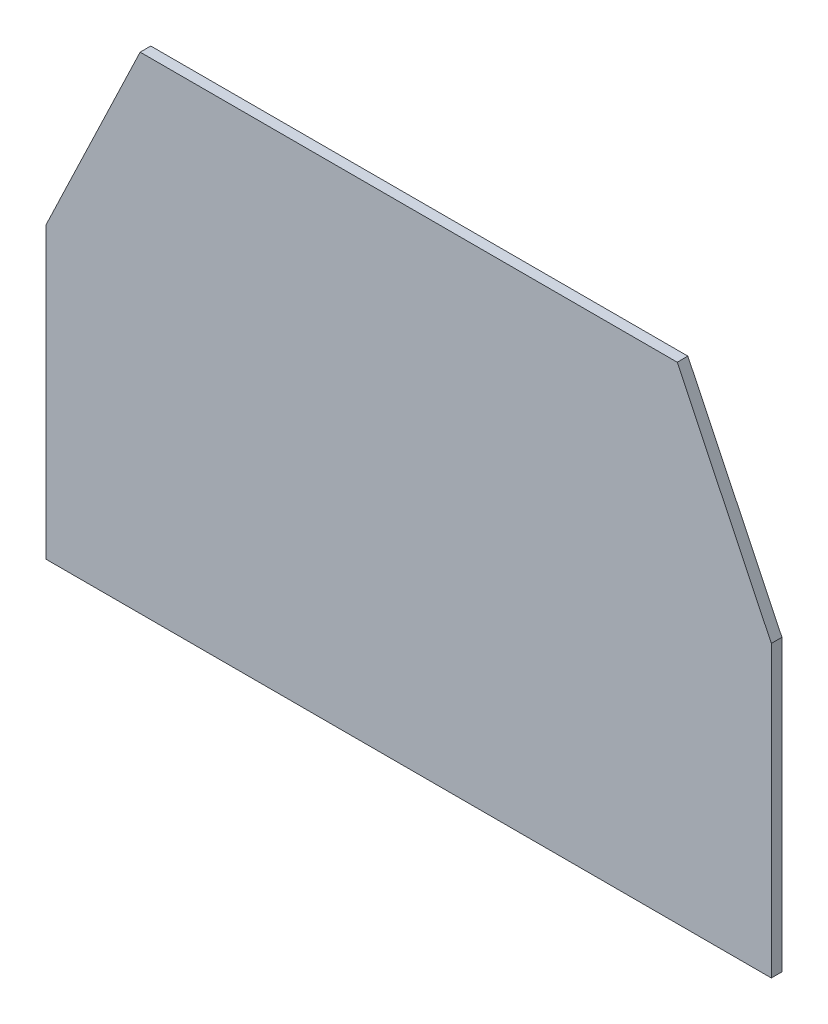
ISO-10303-21;
HEADER;
FILE_DESCRIPTION(('STEP AP214'),'2;1');
FILE_NAME('part.step','',(''),(''),'','','');
FILE_SCHEMA(('AUTOMOTIVE_DESIGN { 1 0 10303 214 1 1 1 1 }'));
ENDSEC;
DATA;
#1=APPLICATION_CONTEXT('core data for automotive mechanical design processes');
#2=APPLICATION_PROTOCOL_DEFINITION('international standard','automotive_design',2000,#1);
#3=PRODUCT_CONTEXT('',#1,'mechanical');
#4=PRODUCT('Part','Part','',(#3));
#5=PRODUCT_RELATED_PRODUCT_CATEGORY('part','',(#4));
#6=PRODUCT_DEFINITION_FORMATION('','',#4);
#7=PRODUCT_DEFINITION_CONTEXT('part definition',#1,'design');
#8=PRODUCT_DEFINITION('design','',#6,#7);
#9=PRODUCT_DEFINITION_SHAPE('','',#8);
#10=(LENGTH_UNIT() NAMED_UNIT(*) SI_UNIT(.MILLI.,.METRE.));
#11=(NAMED_UNIT(*) PLANE_ANGLE_UNIT() SI_UNIT($,.RADIAN.));
#12=(NAMED_UNIT(*) SI_UNIT($,.STERADIAN.) SOLID_ANGLE_UNIT());
#13=UNCERTAINTY_MEASURE_WITH_UNIT(LENGTH_MEASURE(1.E-05),#10,'distance_accuracy_value','');
#14=(GEOMETRIC_REPRESENTATION_CONTEXT(3) GLOBAL_UNCERTAINTY_ASSIGNED_CONTEXT((#13)) GLOBAL_UNIT_ASSIGNED_CONTEXT((#10,
#11,#12)) REPRESENTATION_CONTEXT('',''));
#15=CARTESIAN_POINT('',(0.,0.,0.));
#16=DIRECTION('',(0.,0.,1.));
#17=DIRECTION('',(1.,0.,0.));
#18=AXIS2_PLACEMENT_3D('',#15,#16,#17);
#19=CARTESIAN_POINT('',(-341.858259493534,-194.367647058824,10.));
#20=DIRECTION('',(1.,0.,0.));
#21=DIRECTION('',(0.,1.,0.));
#22=AXIS2_PLACEMENT_3D('',#19,#20,#21);
#23=PLANE('',#22);
#24=DIRECTION('',(0.,-1.,0.));
#25=VECTOR('',#24,1.);
#26=CARTESIAN_POINT('',(-341.858259493534,-194.367647058824,0.));
#27=LINE('',#26,#25);
#28=CARTESIAN_POINT('',(-341.858259493534,78.7945636826585,0.));
#29=VERTEX_POINT('',#28);
#30=CARTESIAN_POINT('',(-341.858259493534,-194.367647058824,0.));
#31=VERTEX_POINT('',#30);
#32=EDGE_CURVE('E117',#29,#31,#27,.T.);
#33=ORIENTED_EDGE('',*,*,#32,.T.);
#34=DIRECTION('',(0.,0.,-1.));
#35=VECTOR('',#34,1.);
#36=CARTESIAN_POINT('',(-341.858259493534,-194.367647058824,10.));
#37=LINE('',#36,#35);
#38=CARTESIAN_POINT('',(-341.858259493534,-194.367647058824,10.));
#39=VERTEX_POINT('',#38);
#40=EDGE_CURVE('E11',#39,#31,#37,.T.);
#41=ORIENTED_EDGE('',*,*,#40,.F.);
#42=DIRECTION('',(0.,-1.,0.));
#43=VECTOR('',#42,1.);
#44=CARTESIAN_POINT('',(-341.858259493534,-194.367647058824,10.));
#45=LINE('',#44,#43);
#46=CARTESIAN_POINT('',(-341.858259493534,78.7945636826585,10.));
#47=VERTEX_POINT('',#46);
#48=EDGE_CURVE('E127',#47,#39,#45,.T.);
#49=ORIENTED_EDGE('',*,*,#48,.F.);
#50=DIRECTION('',(0.,0.,-1.));
#51=VECTOR('',#50,1.);
#52=CARTESIAN_POINT('',(-341.858259493534,78.7945636826585,10.));
#53=LINE('',#52,#51);
#54=EDGE_CURVE('E113',#47,#29,#53,.T.);
#55=ORIENTED_EDGE('',*,*,#54,.T.);
#56=EDGE_LOOP('',(#33,#41,#49,#55));
#57=FACE_BOUND('',#56,.T.);
#58=ADVANCED_FACE('F33',(#57),#23,.F.);
#59=CARTESIAN_POINT('',(341.858259493534,-194.367647058824,10.));
#60=DIRECTION('',(0.,1.,0.));
#61=DIRECTION('',(-1.,0.,0.));
#62=AXIS2_PLACEMENT_3D('',#59,#60,#61);
#63=PLANE('',#62);
#64=DIRECTION('',(1.,0.,0.));
#65=VECTOR('',#64,1.);
#66=CARTESIAN_POINT('',(341.858259493534,-194.367647058824,0.));
#67=LINE('',#66,#65);
#68=CARTESIAN_POINT('',(341.858259493534,-194.367647058824,0.));
#69=VERTEX_POINT('',#68);
#70=EDGE_CURVE('E120',#31,#69,#67,.T.);
#71=ORIENTED_EDGE('',*,*,#70,.T.);
#72=DIRECTION('',(0.,0.,-1.));
#73=VECTOR('',#72,1.);
#74=CARTESIAN_POINT('',(341.858259493534,-194.367647058824,10.));
#75=LINE('',#74,#73);
#76=CARTESIAN_POINT('',(341.858259493534,-194.367647058824,10.));
#77=VERTEX_POINT('',#76);
#78=EDGE_CURVE('E41',#77,#69,#75,.T.);
#79=ORIENTED_EDGE('',*,*,#78,.F.);
#80=DIRECTION('',(1.,0.,0.));
#81=VECTOR('',#80,1.);
#82=CARTESIAN_POINT('',(341.858259493534,-194.367647058824,10.));
#83=LINE('',#82,#81);
#84=EDGE_CURVE('E86',#39,#77,#83,.T.);
#85=ORIENTED_EDGE('',*,*,#84,.F.);
#86=ORIENTED_EDGE('',*,*,#40,.T.);
#87=EDGE_LOOP('',(#71,#79,#85,#86));
#88=FACE_BOUND('',#87,.T.);
#89=ADVANCED_FACE('F151',(#88),#63,.F.);
#90=CARTESIAN_POINT('',(341.858259493534,-194.367647058824,10.));
#91=DIRECTION('',(-1.,0.,0.));
#92=DIRECTION('',(0.,-1.,0.));
#93=AXIS2_PLACEMENT_3D('',#90,#91,#92);
#94=PLANE('',#93);
#95=DIRECTION('',(0.,1.,0.));
#96=VECTOR('',#95,1.);
#97=CARTESIAN_POINT('',(341.858259493534,-194.367647058824,0.));
#98=LINE('',#97,#96);
#99=CARTESIAN_POINT('',(341.858259493534,78.7945636826585,0.));
#100=VERTEX_POINT('',#99);
#101=EDGE_CURVE('E122',#69,#100,#98,.T.);
#102=ORIENTED_EDGE('',*,*,#101,.T.);
#103=DIRECTION('',(0.,0.,-1.));
#104=VECTOR('',#103,1.);
#105=CARTESIAN_POINT('',(341.858259493534,78.7945636826585,10.));
#106=LINE('',#105,#104);
#107=CARTESIAN_POINT('',(341.858259493534,78.7945636826585,10.));
#108=VERTEX_POINT('',#107);
#109=EDGE_CURVE('E108',#108,#100,#106,.T.);
#110=ORIENTED_EDGE('',*,*,#109,.F.);
#111=DIRECTION('',(0.,1.,0.));
#112=VECTOR('',#111,1.);
#113=CARTESIAN_POINT('',(341.858259493534,-194.367647058824,10.));
#114=LINE('',#113,#112);
#115=EDGE_CURVE('E99',#77,#108,#114,.T.);
#116=ORIENTED_EDGE('',*,*,#115,.F.);
#117=ORIENTED_EDGE('',*,*,#78,.T.);
#118=EDGE_LOOP('',(#102,#110,#116,#117));
#119=FACE_BOUND('',#118,.T.);
#120=ADVANCED_FACE('F133',(#119),#94,.F.);
#121=CARTESIAN_POINT('',(341.858259493534,78.7945636826585,10.));
#122=DIRECTION('',(-0.901919134345838,-0.431904937574063,0.));
#123=DIRECTION('',(0.431904937574063,-0.901919134345838,0.));
#124=AXIS2_PLACEMENT_3D('',#121,#122,#123);
#125=PLANE('',#124);
#126=DIRECTION('',(-0.431904937574063,0.901919134345837,0.));
#127=VECTOR('',#126,1.);
#128=CARTESIAN_POINT('',(341.858259493534,78.7945636826585,0.));
#129=LINE('',#128,#127);
#130=CARTESIAN_POINT('',(253.156995608474,264.023673560284,0.));
#131=VERTEX_POINT('',#130);
#132=EDGE_CURVE('E107',#100,#131,#129,.T.);
#133=ORIENTED_EDGE('',*,*,#132,.T.);
#134=DIRECTION('',(0.,0.,-1.));
#135=VECTOR('',#134,1.);
#136=CARTESIAN_POINT('',(253.156995608474,264.023673560284,10.));
#137=LINE('',#136,#135);
#138=CARTESIAN_POINT('',(253.156995608474,264.023673560284,10.));
#139=VERTEX_POINT('',#138);
#140=EDGE_CURVE('E104',#139,#131,#137,.T.);
#141=ORIENTED_EDGE('',*,*,#140,.F.);
#142=DIRECTION('',(-0.431904937574063,0.901919134345837,0.));
#143=VECTOR('',#142,1.);
#144=CARTESIAN_POINT('',(341.858259493534,78.7945636826585,10.));
#145=LINE('',#144,#143);
#146=EDGE_CURVE('E93',#108,#139,#145,.T.);
#147=ORIENTED_EDGE('',*,*,#146,.F.);
#148=ORIENTED_EDGE('',*,*,#109,.T.);
#149=EDGE_LOOP('',(#133,#141,#147,#148));
#150=FACE_BOUND('',#149,.T.);
#151=ADVANCED_FACE('F105',(#150),#125,.F.);
#152=CARTESIAN_POINT('',(253.156995608474,264.023673560284,10.));
#153=DIRECTION('',(0.,-1.,0.));
#154=DIRECTION('',(1.,0.,0.));
#155=AXIS2_PLACEMENT_3D('',#152,#153,#154);
#156=PLANE('',#155);
#157=DIRECTION('',(-1.,0.,0.));
#158=VECTOR('',#157,1.);
#159=CARTESIAN_POINT('',(253.156995608474,264.023673560284,0.));
#160=LINE('',#159,#158);
#161=CARTESIAN_POINT('',(-253.156995608474,264.023673560284,0.));
#162=VERTEX_POINT('',#161);
#163=EDGE_CURVE('E72',#131,#162,#160,.T.);
#164=ORIENTED_EDGE('',*,*,#163,.T.);
#165=DIRECTION('',(0.,0.,-1.));
#166=VECTOR('',#165,1.);
#167=CARTESIAN_POINT('',(-253.156995608474,264.023673560284,10.));
#168=LINE('',#167,#166);
#169=CARTESIAN_POINT('',(-253.156995608474,264.023673560284,10.));
#170=VERTEX_POINT('',#169);
#171=EDGE_CURVE('E109',#170,#162,#168,.T.);
#172=ORIENTED_EDGE('',*,*,#171,.F.);
#173=DIRECTION('',(-1.,0.,0.));
#174=VECTOR('',#173,1.);
#175=CARTESIAN_POINT('',(253.156995608474,264.023673560284,10.));
#176=LINE('',#175,#174);
#177=EDGE_CURVE('E97',#139,#170,#176,.T.);
#178=ORIENTED_EDGE('',*,*,#177,.F.);
#179=ORIENTED_EDGE('',*,*,#140,.T.);
#180=EDGE_LOOP('',(#164,#172,#178,#179));
#181=FACE_BOUND('',#180,.T.);
#182=ADVANCED_FACE('F111',(#181),#156,.F.);
#183=CARTESIAN_POINT('',(-341.858259493534,78.7945636826585,10.));
#184=DIRECTION('',(0.901919134345838,-0.431904937574063,0.));
#185=DIRECTION('',(0.431904937574063,0.901919134345838,0.));
#186=AXIS2_PLACEMENT_3D('',#183,#184,#185);
#187=PLANE('',#186);
#188=DIRECTION('',(-0.431904937574063,-0.901919134345837,0.));
#189=VECTOR('',#188,1.);
#190=CARTESIAN_POINT('',(-341.858259493534,78.7945636826585,0.));
#191=LINE('',#190,#189);
#192=EDGE_CURVE('E78',#162,#29,#191,.T.);
#193=ORIENTED_EDGE('',*,*,#192,.T.);
#194=ORIENTED_EDGE('',*,*,#54,.F.);
#195=DIRECTION('',(-0.431904937574063,-0.901919134345837,0.));
#196=VECTOR('',#195,1.);
#197=CARTESIAN_POINT('',(-341.858259493534,78.7945636826585,10.));
#198=LINE('',#197,#196);
#199=EDGE_CURVE('E49',#170,#47,#198,.T.);
#200=ORIENTED_EDGE('',*,*,#199,.F.);
#201=ORIENTED_EDGE('',*,*,#171,.T.);
#202=EDGE_LOOP('',(#193,#194,#200,#201));
#203=FACE_BOUND('',#202,.T.);
#204=ADVANCED_FACE('F140',(#203),#187,.F.);
#205=CARTESIAN_POINT('',(0.,0.,10.));
#206=DIRECTION('',(0.,0.,1.));
#207=DIRECTION('',(1.,0.,0.));
#208=AXIS2_PLACEMENT_3D('',#205,#206,#207);
#209=PLANE('',#208);
#210=ORIENTED_EDGE('',*,*,#48,.T.);
#211=ORIENTED_EDGE('',*,*,#84,.T.);
#212=ORIENTED_EDGE('',*,*,#115,.T.);
#213=ORIENTED_EDGE('',*,*,#146,.T.);
#214=ORIENTED_EDGE('',*,*,#177,.T.);
#215=ORIENTED_EDGE('',*,*,#199,.T.);
#216=EDGE_LOOP('',(#210,#211,#212,#213,#214,#215));
#217=FACE_BOUND('',#216,.T.);
#218=ADVANCED_FACE('F95',(#217),#209,.T.);
#219=CARTESIAN_POINT('',(0.,0.,0.));
#220=DIRECTION('',(0.,0.,1.));
#221=DIRECTION('',(1.,0.,0.));
#222=AXIS2_PLACEMENT_3D('',#219,#220,#221);
#223=PLANE('',#222);
#224=ORIENTED_EDGE('',*,*,#32,.F.);
#225=ORIENTED_EDGE('',*,*,#192,.F.);
#226=ORIENTED_EDGE('',*,*,#163,.F.);
#227=ORIENTED_EDGE('',*,*,#132,.F.);
#228=ORIENTED_EDGE('',*,*,#101,.F.);
#229=ORIENTED_EDGE('',*,*,#70,.F.);
#230=EDGE_LOOP('',(#224,#225,#226,#227,#228,#229));
#231=FACE_BOUND('',#230,.T.);
#232=ADVANCED_FACE('F136',(#231),#223,.F.);
#233=CLOSED_SHELL('',(#58,#89,#120,#151,#182,#204,#218,#232));
#234=MANIFOLD_SOLID_BREP('B2',#233);
#235=ADVANCED_BREP_SHAPE_REPRESENTATION('',(#18,#234),#14);
#236=SHAPE_DEFINITION_REPRESENTATION(#9,#235);
ENDSEC;
END-ISO-10303-21;
